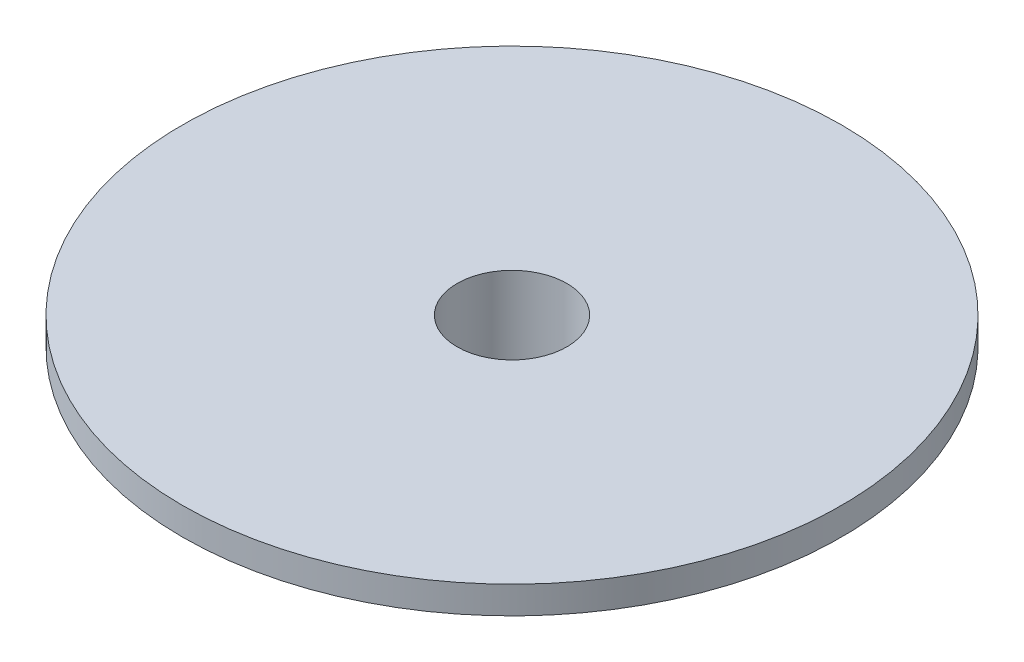
ISO-10303-21;
HEADER;
FILE_DESCRIPTION(('STEP AP214'),'2;1');
FILE_NAME('part.step','',(''),(''),'','','');
FILE_SCHEMA(('AUTOMOTIVE_DESIGN { 1 0 10303 214 1 1 1 1 }'));
ENDSEC;
DATA;
#1=APPLICATION_CONTEXT('core data for automotive mechanical design processes');
#2=APPLICATION_PROTOCOL_DEFINITION('international standard','automotive_design',2000,#1);
#3=PRODUCT_CONTEXT('',#1,'mechanical');
#4=PRODUCT('Part','Part','',(#3));
#5=PRODUCT_RELATED_PRODUCT_CATEGORY('part','',(#4));
#6=PRODUCT_DEFINITION_FORMATION('','',#4);
#7=PRODUCT_DEFINITION_CONTEXT('part definition',#1,'design');
#8=PRODUCT_DEFINITION('design','',#6,#7);
#9=PRODUCT_DEFINITION_SHAPE('','',#8);
#10=(LENGTH_UNIT() NAMED_UNIT(*) SI_UNIT(.MILLI.,.METRE.));
#11=(NAMED_UNIT(*) PLANE_ANGLE_UNIT() SI_UNIT($,.RADIAN.));
#12=(NAMED_UNIT(*) SI_UNIT($,.STERADIAN.) SOLID_ANGLE_UNIT());
#13=UNCERTAINTY_MEASURE_WITH_UNIT(LENGTH_MEASURE(1.E-05),#10,'distance_accuracy_value','');
#14=(GEOMETRIC_REPRESENTATION_CONTEXT(3) GLOBAL_UNCERTAINTY_ASSIGNED_CONTEXT((#13)) GLOBAL_UNIT_ASSIGNED_CONTEXT((#10,
#11,#12)) REPRESENTATION_CONTEXT('',''));
#15=CARTESIAN_POINT('',(0.,0.,0.));
#16=DIRECTION('',(0.,0.,1.));
#17=DIRECTION('',(1.,0.,0.));
#18=AXIS2_PLACEMENT_3D('',#15,#16,#17);
#19=CARTESIAN_POINT('',(3.89035270259153,0.,2.21042737559322));
#20=DIRECTION('',(0.,-1.,0.));
#21=DIRECTION('',(0.,0.,-1.));
#22=AXIS2_PLACEMENT_3D('',#19,#20,#21);
#23=PLANE('',#22);
#24=DIRECTION('',(-0.00690363957882424,0.,-0.999976169596339));
#25=VECTOR('',#24,1.);
#26=CARTESIAN_POINT('',(3.89035270259153,0.,2.21042737559322));
#27=LINE('',#26,#25);
#28=CARTESIAN_POINT('',(3.89035270259153,0.,2.21042737559322));
#29=VERTEX_POINT('',#28);
#30=CARTESIAN_POINT('',(3.85946261178006,0.,-2.2639305823291));
#31=VERTEX_POINT('',#30);
#32=EDGE_CURVE('E117',#29,#31,#27,.T.);
#33=ORIENTED_EDGE('',*,*,#32,.F.);
#34=DIRECTION('',(0.862552946260074,0.,-0.505966812052003));
#35=VECTOR('',#34,1.);
#36=CARTESIAN_POINT('',(0.0308900908114716,0.,4.47435795792233));
#37=LINE('',#36,#35);
#38=CARTESIAN_POINT('',(0.0308900908114716,0.,4.47435795792233));
#39=VERTEX_POINT('',#38);
#40=EDGE_CURVE('E139',#39,#29,#37,.T.);
#41=ORIENTED_EDGE('',*,*,#40,.F.);
#42=DIRECTION('',(0.869456585838897,0.,0.494009357544337));
#43=VECTOR('',#42,1.);
#44=CARTESIAN_POINT('',(-3.85946261178006,0.,2.2639305823291));
#45=LINE('',#44,#43);
#46=CARTESIAN_POINT('',(-3.85946261178006,0.,2.2639305823291));
#47=VERTEX_POINT('',#46);
#48=EDGE_CURVE('E136',#47,#39,#45,.T.);
#49=ORIENTED_EDGE('',*,*,#48,.F.);
#50=DIRECTION('',(0.00690363957882444,0.,0.999976169596339));
#51=VECTOR('',#50,1.);
#52=CARTESIAN_POINT('',(-3.89035270259153,0.,-2.21042737559322));
#53=LINE('',#52,#51);
#54=CARTESIAN_POINT('',(-3.89035270259153,0.,-2.21042737559322));
#55=VERTEX_POINT('',#54);
#56=EDGE_CURVE('E133',#55,#47,#53,.T.);
#57=ORIENTED_EDGE('',*,*,#56,.F.);
#58=DIRECTION('',(-0.862552946260073,0.,0.505966812052003));
#59=VECTOR('',#58,1.);
#60=CARTESIAN_POINT('',(-0.0308900908114723,0.,-4.47435795792232));
#61=LINE('',#60,#59);
#62=CARTESIAN_POINT('',(-0.0308900908114723,0.,-4.47435795792232));
#63=VERTEX_POINT('',#62);
#64=EDGE_CURVE('E120',#63,#55,#61,.T.);
#65=ORIENTED_EDGE('',*,*,#64,.F.);
#66=DIRECTION('',(-0.869456585838897,0.,-0.494009357544337));
#67=VECTOR('',#66,1.);
#68=CARTESIAN_POINT('',(3.85946261178006,0.,-2.2639305823291));
#69=LINE('',#68,#67);
#70=EDGE_CURVE('E106',#31,#63,#69,.T.);
#71=ORIENTED_EDGE('',*,*,#70,.F.);
#72=EDGE_LOOP('',(#33,#41,#49,#57,#65,#71));
#73=FACE_BOUND('',#72,.T.);
#74=CARTESIAN_POINT('',(0.,0.,0.));
#75=DIRECTION('',(0.,1.,0.));
#76=DIRECTION('',(0.,0.,1.));
#77=AXIS2_PLACEMENT_3D('',#74,#75,#76);
#78=CIRCLE('',#77,2.);
#79=CARTESIAN_POINT('',(0.,0.,2.));
#80=VERTEX_POINT('',#79);
#81=EDGE_CURVE('E125',#80,#80,#78,.T.);
#82=ORIENTED_EDGE('',*,*,#81,.T.);
#83=EDGE_LOOP('',(#82));
#84=FACE_BOUND('',#83,.T.);
#85=ADVANCED_FACE('F33',(#73,#84),#23,.T.);
#86=CARTESIAN_POINT('',(3.89035270259153,3.125,2.21042737559322));
#87=DIRECTION('',(-0.999976169596339,0.,0.00690363957882425));
#88=DIRECTION('',(0.00690363957882425,0.,0.999976169596339));
#89=AXIS2_PLACEMENT_3D('',#86,#87,#88);
#90=PLANE('',#89);
#91=DIRECTION('',(0.,-1.,0.));
#92=VECTOR('',#91,1.);
#93=CARTESIAN_POINT('',(3.85946261178006,3.125,-2.2639305823291));
#94=LINE('',#93,#92);
#95=CARTESIAN_POINT('',(3.85946261178006,2.125,-2.2639305823291));
#96=VERTEX_POINT('',#95);
#97=EDGE_CURVE('E103',#96,#31,#94,.T.);
#98=ORIENTED_EDGE('',*,*,#97,.F.);
#99=DIRECTION('',(-0.00690363957882425,0.,-0.999976169596339));
#100=VECTOR('',#99,1.);
#101=CARTESIAN_POINT('',(3.89035270259153,2.125,2.21042737559322));
#102=LINE('',#101,#100);
#103=CARTESIAN_POINT('',(3.89035270259153,2.125,2.21042737559322));
#104=VERTEX_POINT('',#103);
#105=EDGE_CURVE('E42',#96,#104,#102,.F.);
#106=ORIENTED_EDGE('',*,*,#105,.T.);
#107=DIRECTION('',(0.,-1.,0.));
#108=VECTOR('',#107,1.);
#109=CARTESIAN_POINT('',(3.89035270259153,3.125,2.21042737559322));
#110=LINE('',#109,#108);
#111=EDGE_CURVE('E123',#104,#29,#110,.T.);
#112=ORIENTED_EDGE('',*,*,#111,.T.);
#113=ORIENTED_EDGE('',*,*,#32,.T.);
#114=EDGE_LOOP('',(#98,#106,#112,#113));
#115=FACE_BOUND('',#114,.T.);
#116=ADVANCED_FACE('F122',(#115),#90,.F.);
#117=CARTESIAN_POINT('',(3.85946261178006,3.125,-2.2639305823291));
#118=DIRECTION('',(-0.494009357544337,0.,0.869456585838898));
#119=DIRECTION('',(0.869456585838898,0.,0.494009357544337));
#120=AXIS2_PLACEMENT_3D('',#117,#118,#119);
#121=PLANE('',#120);
#122=DIRECTION('',(0.,-1.,0.));
#123=VECTOR('',#122,1.);
#124=CARTESIAN_POINT('',(-0.0308900908114723,3.125,-4.47435795792232));
#125=LINE('',#124,#123);
#126=CARTESIAN_POINT('',(-0.0308900908114723,2.125,-4.47435795792232));
#127=VERTEX_POINT('',#126);
#128=EDGE_CURVE('E111',#127,#63,#125,.T.);
#129=ORIENTED_EDGE('',*,*,#128,.F.);
#130=DIRECTION('',(-0.869456585838898,0.,-0.494009357544337));
#131=VECTOR('',#130,1.);
#132=CARTESIAN_POINT('',(3.85946261178006,2.125,-2.2639305823291));
#133=LINE('',#132,#131);
#134=EDGE_CURVE('E57',#127,#96,#133,.F.);
#135=ORIENTED_EDGE('',*,*,#134,.T.);
#136=ORIENTED_EDGE('',*,*,#97,.T.);
#137=ORIENTED_EDGE('',*,*,#70,.T.);
#138=EDGE_LOOP('',(#129,#135,#136,#137));
#139=FACE_BOUND('',#138,.T.);
#140=ADVANCED_FACE('F105',(#139),#121,.F.);
#141=CARTESIAN_POINT('',(-0.0308900908114723,3.125,-4.47435795792232));
#142=DIRECTION('',(0.505966812052003,0.,0.862552946260073));
#143=DIRECTION('',(0.862552946260073,0.,-0.505966812052003));
#144=AXIS2_PLACEMENT_3D('',#141,#142,#143);
#145=PLANE('',#144);
#146=DIRECTION('',(0.,-1.,0.));
#147=VECTOR('',#146,1.);
#148=CARTESIAN_POINT('',(-3.89035270259153,3.125,-2.21042737559322));
#149=LINE('',#148,#147);
#150=CARTESIAN_POINT('',(-3.89035270259153,2.125,-2.21042737559322));
#151=VERTEX_POINT('',#150);
#152=EDGE_CURVE('E146',#151,#55,#149,.T.);
#153=ORIENTED_EDGE('',*,*,#152,.F.);
#154=DIRECTION('',(-0.862552946260073,0.,0.505966812052003));
#155=VECTOR('',#154,1.);
#156=CARTESIAN_POINT('',(-0.0308900908114724,2.125,-4.47435795792232));
#157=LINE('',#156,#155);
#158=EDGE_CURVE('E166',#151,#127,#157,.F.);
#159=ORIENTED_EDGE('',*,*,#158,.T.);
#160=ORIENTED_EDGE('',*,*,#128,.T.);
#161=ORIENTED_EDGE('',*,*,#64,.T.);
#162=EDGE_LOOP('',(#153,#159,#160,#161));
#163=FACE_BOUND('',#162,.T.);
#164=ADVANCED_FACE('F238',(#163),#145,.F.);
#165=CARTESIAN_POINT('',(-3.89035270259153,3.125,-2.21042737559322));
#166=DIRECTION('',(0.999976169596339,0.,-0.00690363957882444));
#167=DIRECTION('',(-0.00690363957882444,0.,-0.999976169596339));
#168=AXIS2_PLACEMENT_3D('',#165,#166,#167);
#169=PLANE('',#168);
#170=DIRECTION('',(0.,-1.,0.));
#171=VECTOR('',#170,1.);
#172=CARTESIAN_POINT('',(-3.85946261178006,3.125,2.2639305823291));
#173=LINE('',#172,#171);
#174=CARTESIAN_POINT('',(-3.85946261178006,2.125,2.2639305823291));
#175=VERTEX_POINT('',#174);
#176=EDGE_CURVE('E144',#175,#47,#173,.T.);
#177=ORIENTED_EDGE('',*,*,#176,.F.);
#178=DIRECTION('',(0.00690363957882444,0.,0.999976169596339));
#179=VECTOR('',#178,1.);
#180=CARTESIAN_POINT('',(-3.89035270259153,2.125,-2.21042737559322));
#181=LINE('',#180,#179);
#182=EDGE_CURVE('E164',#175,#151,#181,.F.);
#183=ORIENTED_EDGE('',*,*,#182,.T.);
#184=ORIENTED_EDGE('',*,*,#152,.T.);
#185=ORIENTED_EDGE('',*,*,#56,.T.);
#186=EDGE_LOOP('',(#177,#183,#184,#185));
#187=FACE_BOUND('',#186,.T.);
#188=ADVANCED_FACE('F234',(#187),#169,.F.);
#189=CARTESIAN_POINT('',(-3.85946261178006,3.125,2.2639305823291));
#190=DIRECTION('',(0.494009357544337,0.,-0.869456585838897));
#191=DIRECTION('',(-0.869456585838897,0.,-0.494009357544337));
#192=AXIS2_PLACEMENT_3D('',#189,#190,#191);
#193=PLANE('',#192);
#194=DIRECTION('',(0.,-1.,0.));
#195=VECTOR('',#194,1.);
#196=CARTESIAN_POINT('',(0.0308900908114716,3.125,4.47435795792233));
#197=LINE('',#196,#195);
#198=CARTESIAN_POINT('',(0.0308900908114716,2.125,4.47435795792233));
#199=VERTEX_POINT('',#198);
#200=EDGE_CURVE('E142',#199,#39,#197,.T.);
#201=ORIENTED_EDGE('',*,*,#200,.F.);
#202=DIRECTION('',(0.869456585838897,0.,0.494009357544337));
#203=VECTOR('',#202,1.);
#204=CARTESIAN_POINT('',(-3.85946261178006,2.125,2.2639305823291));
#205=LINE('',#204,#203);
#206=EDGE_CURVE('E161',#199,#175,#205,.F.);
#207=ORIENTED_EDGE('',*,*,#206,.T.);
#208=ORIENTED_EDGE('',*,*,#176,.T.);
#209=ORIENTED_EDGE('',*,*,#48,.T.);
#210=EDGE_LOOP('',(#201,#207,#208,#209));
#211=FACE_BOUND('',#210,.T.);
#212=ADVANCED_FACE('F230',(#211),#193,.F.);
#213=CARTESIAN_POINT('',(0.0308900908114716,3.125,4.47435795792233));
#214=DIRECTION('',(-0.505966812052003,0.,-0.862552946260074));
#215=DIRECTION('',(-0.862552946260074,0.,0.505966812052003));
#216=AXIS2_PLACEMENT_3D('',#213,#214,#215);
#217=PLANE('',#216);
#218=ORIENTED_EDGE('',*,*,#111,.F.);
#219=DIRECTION('',(0.862552946260074,0.,-0.505966812052003));
#220=VECTOR('',#219,1.);
#221=CARTESIAN_POINT('',(0.0308900908114715,2.125,4.47435795792233));
#222=LINE('',#221,#220);
#223=EDGE_CURVE('E11',#104,#199,#222,.F.);
#224=ORIENTED_EDGE('',*,*,#223,.T.);
#225=ORIENTED_EDGE('',*,*,#200,.T.);
#226=ORIENTED_EDGE('',*,*,#40,.T.);
#227=EDGE_LOOP('',(#218,#224,#225,#226));
#228=FACE_BOUND('',#227,.T.);
#229=ADVANCED_FACE('F218',(#228),#217,.F.);
#230=CARTESIAN_POINT('',(0.,3.125,0.));
#231=DIRECTION('',(0.,-1.,0.));
#232=DIRECTION('',(0.,0.,-1.));
#233=AXIS2_PLACEMENT_3D('',#230,#231,#232);
#234=CYLINDRICAL_SURFACE('',#233,2.);
#235=ORIENTED_EDGE('',*,*,#81,.F.);
#236=EDGE_LOOP('',(#235));
#237=FACE_BOUND('',#236,.T.);
#238=CARTESIAN_POINT('',(0.,4.125,0.));
#239=DIRECTION('',(0.,1.,0.));
#240=DIRECTION('',(0.,0.,1.));
#241=AXIS2_PLACEMENT_3D('',#238,#239,#240);
#242=CIRCLE('',#241,2.);
#243=CARTESIAN_POINT('',(0.,4.125,2.));
#244=VERTEX_POINT('',#243);
#245=EDGE_CURVE('E184',#244,#244,#242,.T.);
#246=ORIENTED_EDGE('',*,*,#245,.T.);
#247=EDGE_LOOP('',(#246));
#248=FACE_BOUND('',#247,.T.);
#249=ADVANCED_FACE('F210',(#237,#248),#234,.F.);
#250=CARTESIAN_POINT('',(0.,3.125,0.));
#251=DIRECTION('',(0.,1.,0.));
#252=DIRECTION('',(0.,0.,1.));
#253=AXIS2_PLACEMENT_3D('',#250,#251,#252);
#254=PLANE('',#253);
#255=DIRECTION('',(0.00690363957882444,0.,0.999976169596339));
#256=VECTOR('',#255,1.);
#257=CARTESIAN_POINT('',(-4.8594387813764,3.125,2.27083422190793));
#258=LINE('',#257,#256);
#259=CARTESIAN_POINT('',(-4.89431469035709,3.125,-2.78086024671405));
#260=VERTEX_POINT('',#259);
#261=CARTESIAN_POINT('',(-4.85545296320718,3.125,2.84817073260759));
#262=VERTEX_POINT('',#261);
#263=EDGE_CURVE('E156',#260,#262,#258,.T.);
#264=ORIENTED_EDGE('',*,*,#263,.T.);
#265=DIRECTION('',(0.869456585838897,0.,0.494009357544337));
#266=VECTOR('',#265,1.);
#267=CARTESIAN_POINT('',(-0.463119266732865,3.125,5.34381454376122));
#268=LINE('',#267,#266);
#269=CARTESIAN_POINT('',(0.0388617271499165,3.125,5.62903097932164));
#270=VERTEX_POINT('',#269);
#271=EDGE_CURVE('E158',#262,#270,#268,.T.);
#272=ORIENTED_EDGE('',*,*,#271,.T.);
#273=DIRECTION('',(0.862552946260074,0.,-0.505966812052003));
#274=VECTOR('',#273,1.);
#275=CARTESIAN_POINT('',(4.39631951464354,3.125,3.07298032185329));
#276=LINE('',#275,#274);
#277=CARTESIAN_POINT('',(4.89431469035709,3.125,2.78086024671405));
#278=VERTEX_POINT('',#277);
#279=EDGE_CURVE('E110',#270,#278,#276,.T.);
#280=ORIENTED_EDGE('',*,*,#279,.T.);
#281=DIRECTION('',(-0.00690363957882425,0.,-0.999976169596339));
#282=VECTOR('',#281,1.);
#283=CARTESIAN_POINT('',(4.8594387813764,3.125,-2.27083422190793));
#284=LINE('',#283,#282);
#285=CARTESIAN_POINT('',(4.85545296320718,3.125,-2.84817073260758));
#286=VERTEX_POINT('',#285);
#287=EDGE_CURVE('E150',#278,#286,#284,.T.);
#288=ORIENTED_EDGE('',*,*,#287,.T.);
#289=DIRECTION('',(-0.869456585838898,0.,-0.494009357544337));
#290=VECTOR('',#289,1.);
#291=CARTESIAN_POINT('',(0.463119266732864,3.125,-5.34381454376122));
#292=LINE('',#291,#290);
#293=CARTESIAN_POINT('',(-0.0388617271499161,3.125,-5.62903097932164));
#294=VERTEX_POINT('',#293);
#295=EDGE_CURVE('E152',#286,#294,#292,.T.);
#296=ORIENTED_EDGE('',*,*,#295,.T.);
#297=DIRECTION('',(-0.862552946260073,0.,0.505966812052003));
#298=VECTOR('',#297,1.);
#299=CARTESIAN_POINT('',(-4.39631951464354,3.125,-3.07298032185329));
#300=LINE('',#299,#298);
#301=EDGE_CURVE('E154',#294,#260,#300,.T.);
#302=ORIENTED_EDGE('',*,*,#301,.T.);
#303=EDGE_LOOP('',(#264,#272,#280,#288,#296,#302));
#304=FACE_BOUND('',#303,.T.);
#305=CARTESIAN_POINT('',(0.,3.125,0.));
#306=DIRECTION('',(0.,1.,0.));
#307=DIRECTION('',(0.,0.,1.));
#308=AXIS2_PLACEMENT_3D('',#305,#306,#307);
#309=CIRCLE('',#308,12.);
#310=CARTESIAN_POINT('',(0.,3.125,12.));
#311=VERTEX_POINT('',#310);
#312=EDGE_CURVE('E190',#311,#311,#309,.T.);
#313=ORIENTED_EDGE('',*,*,#312,.F.);
#314=EDGE_LOOP('',(#313));
#315=FACE_BOUND('',#314,.T.);
#316=ADVANCED_FACE('F208',(#304,#315),#254,.F.);
#317=CARTESIAN_POINT('',(0.,4.125,0.));
#318=DIRECTION('',(0.,1.,0.));
#319=DIRECTION('',(0.,0.,1.));
#320=AXIS2_PLACEMENT_3D('',#317,#318,#319);
#321=PLANE('',#320);
#322=CARTESIAN_POINT('',(0.,4.125,0.));
#323=DIRECTION('',(0.,1.,0.));
#324=DIRECTION('',(0.,0.,1.));
#325=AXIS2_PLACEMENT_3D('',#322,#323,#324);
#326=CIRCLE('',#325,12.);
#327=CARTESIAN_POINT('',(0.,4.125,12.));
#328=VERTEX_POINT('',#327);
#329=EDGE_CURVE('E128',#328,#328,#326,.T.);
#330=ORIENTED_EDGE('',*,*,#329,.T.);
#331=EDGE_LOOP('',(#330));
#332=FACE_BOUND('',#331,.T.);
#333=ORIENTED_EDGE('',*,*,#245,.F.);
#334=EDGE_LOOP('',(#333));
#335=FACE_BOUND('',#334,.T.);
#336=ADVANCED_FACE('F199',(#332,#335),#321,.T.);
#337=CARTESIAN_POINT('',(0.,4.125,0.));
#338=DIRECTION('',(0.,-1.,0.));
#339=DIRECTION('',(0.,0.,-1.));
#340=AXIS2_PLACEMENT_3D('',#337,#338,#339);
#341=CYLINDRICAL_SURFACE('',#340,12.);
#342=ORIENTED_EDGE('',*,*,#329,.F.);
#343=EDGE_LOOP('',(#342));
#344=FACE_BOUND('',#343,.T.);
#345=ORIENTED_EDGE('',*,*,#312,.T.);
#346=EDGE_LOOP('',(#345));
#347=FACE_BOUND('',#346,.T.);
#348=ADVANCED_FACE('F202',(#344,#347),#341,.T.);
#349=CARTESIAN_POINT('',(2.40829561802863,2.125,-4.23860085596461));
#350=DIRECTION('',(0.869456585838898,0.,0.494009357544337));
#351=DIRECTION('',(0.494009357544337,0.,-0.869456585838898));
#352=AXIS2_PLACEMENT_3D('',#349,#350,#351);
#353=CYLINDRICAL_SURFACE('',#352,1.);
#354=CARTESIAN_POINT('',(4.85545296320718,2.125,-2.84817073260758));
#355=DIRECTION('',(0.505966812052003,0.,0.862552946260074));
#356=DIRECTION('',(-0.862552946260074,0.,0.505966812052002));
#357=AXIS2_PLACEMENT_3D('',#354,#355,#356);
#358=ELLIPSE('',#357,1.15470053837925,1.);
#359=EDGE_CURVE('E179',#96,#286,#358,.F.);
#360=ORIENTED_EDGE('',*,*,#359,.F.);
#361=ORIENTED_EDGE('',*,*,#134,.F.);
#362=CARTESIAN_POINT('',(-0.0388617271499167,2.125,-5.62903097932164));
#363=DIRECTION('',(0.999976169596339,0.,-0.00690363957882405));
#364=DIRECTION('',(0.00690363957882422,0.,0.999976169596339));
#365=AXIS2_PLACEMENT_3D('',#362,#363,#364);
#366=ELLIPSE('',#365,1.15470053837925,1.);
#367=EDGE_CURVE('E37',#294,#127,#366,.T.);
#368=ORIENTED_EDGE('',*,*,#367,.F.);
#369=ORIENTED_EDGE('',*,*,#295,.F.);
#370=EDGE_LOOP('',(#360,#361,#368,#369));
#371=FACE_BOUND('',#370,.T.);
#372=ADVANCED_FACE('F35',(#371),#353,.F.);
#373=CARTESIAN_POINT('',(-2.46658820875351,2.125,-4.20494561301784));
#374=DIRECTION('',(0.862552946260073,0.,-0.505966812052003));
#375=DIRECTION('',(-0.505966812052003,0.,-0.862552946260073));
#376=AXIS2_PLACEMENT_3D('',#373,#374,#375);
#377=CYLINDRICAL_SURFACE('',#376,1.);
#378=ORIENTED_EDGE('',*,*,#367,.T.);
#379=ORIENTED_EDGE('',*,*,#158,.F.);
#380=CARTESIAN_POINT('',(-4.89431469035709,2.125,-2.78086024671405));
#381=DIRECTION('',(0.494009357544336,0.,-0.869456585838898));
#382=DIRECTION('',(0.869456585838898,0.,0.494009357544336));
#383=AXIS2_PLACEMENT_3D('',#380,#381,#382);
#384=ELLIPSE('',#383,1.15470053837925,1.);
#385=EDGE_CURVE('E177',#260,#151,#384,.T.);
#386=ORIENTED_EDGE('',*,*,#385,.F.);
#387=ORIENTED_EDGE('',*,*,#301,.F.);
#388=EDGE_LOOP('',(#378,#379,#386,#387));
#389=FACE_BOUND('',#388,.T.);
#390=ADVANCED_FACE('F259',(#389),#377,.F.);
#391=CARTESIAN_POINT('',(4.87488382678214,2.125,-0.0336552429467681));
#392=DIRECTION('',(0.00690363957882425,0.,0.999976169596339));
#393=DIRECTION('',(0.999976169596339,0.,-0.00690363957882425));
#394=AXIS2_PLACEMENT_3D('',#391,#392,#393);
#395=CYLINDRICAL_SURFACE('',#394,1.);
#396=ORIENTED_EDGE('',*,*,#359,.T.);
#397=ORIENTED_EDGE('',*,*,#287,.F.);
#398=CARTESIAN_POINT('',(4.89431469035709,2.125,2.78086024671405));
#399=DIRECTION('',(-0.494009357544336,0.,0.869456585838898));
#400=DIRECTION('',(-0.869456585838898,0.,-0.494009357544336));
#401=AXIS2_PLACEMENT_3D('',#398,#399,#400);
#402=ELLIPSE('',#401,1.15470053837925,1.);
#403=EDGE_CURVE('E174',#104,#278,#402,.F.);
#404=ORIENTED_EDGE('',*,*,#403,.F.);
#405=ORIENTED_EDGE('',*,*,#105,.F.);
#406=EDGE_LOOP('',(#396,#397,#404,#405));
#407=FACE_BOUND('',#406,.T.);
#408=ADVANCED_FACE('F256',(#407),#395,.F.);
#409=CARTESIAN_POINT('',(-4.87488382678213,2.125,0.033655242946769));
#410=DIRECTION('',(-0.00690363957882444,0.,-0.999976169596339));
#411=DIRECTION('',(-0.999976169596339,0.,0.00690363957882444));
#412=AXIS2_PLACEMENT_3D('',#409,#410,#411);
#413=CYLINDRICAL_SURFACE('',#412,1.);
#414=ORIENTED_EDGE('',*,*,#385,.T.);
#415=ORIENTED_EDGE('',*,*,#182,.F.);
#416=CARTESIAN_POINT('',(-4.85545296320718,2.125,2.84817073260759));
#417=DIRECTION('',(-0.505966812052003,0.,-0.862552946260074));
#418=DIRECTION('',(0.862552946260074,0.,-0.505966812052003));
#419=AXIS2_PLACEMENT_3D('',#416,#417,#418);
#420=ELLIPSE('',#419,1.15470053837925,1.);
#421=EDGE_CURVE('E172',#262,#175,#420,.T.);
#422=ORIENTED_EDGE('',*,*,#421,.F.);
#423=ORIENTED_EDGE('',*,*,#263,.F.);
#424=EDGE_LOOP('',(#414,#415,#422,#423));
#425=FACE_BOUND('',#424,.T.);
#426=ADVANCED_FACE('F252',(#425),#413,.F.);
#427=CARTESIAN_POINT('',(2.46658820875351,2.125,4.20494561301785));
#428=DIRECTION('',(-0.862552946260074,0.,0.505966812052003));
#429=DIRECTION('',(0.505966812052003,0.,0.862552946260074));
#430=AXIS2_PLACEMENT_3D('',#427,#428,#429);
#431=CYLINDRICAL_SURFACE('',#430,1.);
#432=ORIENTED_EDGE('',*,*,#403,.T.);
#433=ORIENTED_EDGE('',*,*,#279,.F.);
#434=CARTESIAN_POINT('',(0.0388617271499174,2.125,5.62903097932164));
#435=DIRECTION('',(-0.999976169596339,0.,0.00690363957882389));
#436=DIRECTION('',(0.00690363957882389,0.,0.999976169596339));
#437=AXIS2_PLACEMENT_3D('',#434,#435,#436);
#438=ELLIPSE('',#437,1.15470053837925,1.);
#439=EDGE_CURVE('E170',#199,#270,#438,.F.);
#440=ORIENTED_EDGE('',*,*,#439,.F.);
#441=ORIENTED_EDGE('',*,*,#223,.F.);
#442=EDGE_LOOP('',(#432,#433,#440,#441));
#443=FACE_BOUND('',#442,.T.);
#444=ADVANCED_FACE('F248',(#443),#431,.F.);
#445=CARTESIAN_POINT('',(-2.40829561802863,2.125,4.23860085596461));
#446=DIRECTION('',(-0.869456585838897,0.,-0.494009357544337));
#447=DIRECTION('',(-0.494009357544337,0.,0.869456585838897));
#448=AXIS2_PLACEMENT_3D('',#445,#446,#447);
#449=CYLINDRICAL_SURFACE('',#448,1.);
#450=ORIENTED_EDGE('',*,*,#421,.T.);
#451=ORIENTED_EDGE('',*,*,#206,.F.);
#452=ORIENTED_EDGE('',*,*,#439,.T.);
#453=ORIENTED_EDGE('',*,*,#271,.F.);
#454=EDGE_LOOP('',(#450,#451,#452,#453));
#455=FACE_BOUND('',#454,.T.);
#456=ADVANCED_FACE('F245',(#455),#449,.F.);
#457=CLOSED_SHELL('',(#85,#116,#140,#164,#188,#212,#229,#249,#316,#336,#348,#372,#390,#408,#426,
#444,#456));
#458=MANIFOLD_SOLID_BREP('B2',#457);
#459=ADVANCED_BREP_SHAPE_REPRESENTATION('',(#18,#458),#14);
#460=SHAPE_DEFINITION_REPRESENTATION(#9,#459);
ENDSEC;
END-ISO-10303-21;
